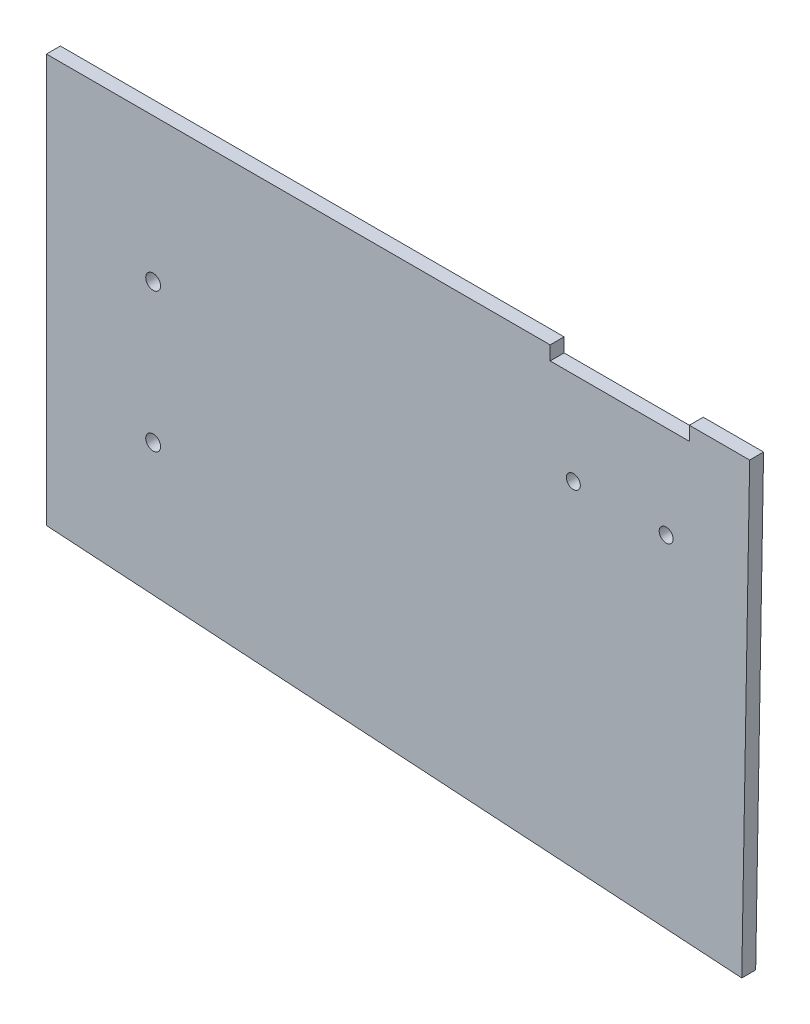
ISO-10303-21;
HEADER;
FILE_DESCRIPTION(('STEP AP214'),'2;1');
FILE_NAME('part.step','',(''),(''),'','','');
FILE_SCHEMA(('AUTOMOTIVE_DESIGN { 1 0 10303 214 1 1 1 1 }'));
ENDSEC;
DATA;
#1=APPLICATION_CONTEXT('core data for automotive mechanical design processes');
#2=APPLICATION_PROTOCOL_DEFINITION('international standard','automotive_design',2000,#1);
#3=PRODUCT_CONTEXT('',#1,'mechanical');
#4=PRODUCT('Part','Part','',(#3));
#5=PRODUCT_RELATED_PRODUCT_CATEGORY('part','',(#4));
#6=PRODUCT_DEFINITION_FORMATION('','',#4);
#7=PRODUCT_DEFINITION_CONTEXT('part definition',#1,'design');
#8=PRODUCT_DEFINITION('design','',#6,#7);
#9=PRODUCT_DEFINITION_SHAPE('','',#8);
#10=(LENGTH_UNIT() NAMED_UNIT(*) SI_UNIT(.MILLI.,.METRE.));
#11=(NAMED_UNIT(*) PLANE_ANGLE_UNIT() SI_UNIT($,.RADIAN.));
#12=(NAMED_UNIT(*) SI_UNIT($,.STERADIAN.) SOLID_ANGLE_UNIT());
#13=UNCERTAINTY_MEASURE_WITH_UNIT(LENGTH_MEASURE(1.E-05),#10,'distance_accuracy_value','');
#14=(GEOMETRIC_REPRESENTATION_CONTEXT(3) GLOBAL_UNCERTAINTY_ASSIGNED_CONTEXT((#13)) GLOBAL_UNIT_ASSIGNED_CONTEXT((#10,
#11,#12)) REPRESENTATION_CONTEXT('',''));
#15=CARTESIAN_POINT('',(0.,0.,0.));
#16=DIRECTION('',(0.,0.,1.));
#17=DIRECTION('',(1.,0.,0.));
#18=AXIS2_PLACEMENT_3D('',#15,#16,#17);
#19=CARTESIAN_POINT('',(-33.3553390593279,3.00000000000293,3.));
#20=DIRECTION('',(0.,-1.,0.));
#21=DIRECTION('',(0.,0.,-1.));
#22=AXIS2_PLACEMENT_3D('',#19,#20,#21);
#23=PLANE('',#22);
#24=DIRECTION('',(-1.,0.,0.));
#25=VECTOR('',#24,1.);
#26=CARTESIAN_POINT('',(-33.3553390593279,3.00000000000293,0.));
#27=LINE('',#26,#25);
#28=CARTESIAN_POINT('',(118.208152801713,3.00000000000293,0.));
#29=VERTEX_POINT('',#28);
#30=CARTESIAN_POINT('',(105.208152801713,3.00000000000293,0.));
#31=VERTEX_POINT('',#30);
#32=EDGE_CURVE('E124',#29,#31,#27,.T.);
#33=ORIENTED_EDGE('',*,*,#32,.T.);
#34=DIRECTION('',(0.,0.,1.));
#35=VECTOR('',#34,1.);
#36=CARTESIAN_POINT('',(105.208152801713,3.00000000000293,0.));
#37=LINE('',#36,#35);
#38=CARTESIAN_POINT('',(105.208152801713,3.00000000000293,3.));
#39=VERTEX_POINT('',#38);
#40=EDGE_CURVE('E151',#31,#39,#37,.T.);
#41=ORIENTED_EDGE('',*,*,#40,.T.);
#42=DIRECTION('',(-1.,0.,0.));
#43=VECTOR('',#42,1.);
#44=CARTESIAN_POINT('',(-33.3553390593279,3.00000000000293,3.));
#45=LINE('',#44,#43);
#46=CARTESIAN_POINT('',(118.208152801713,3.00000000000293,3.));
#47=VERTEX_POINT('',#46);
#48=EDGE_CURVE('E136',#47,#39,#45,.T.);
#49=ORIENTED_EDGE('',*,*,#48,.F.);
#50=DIRECTION('',(0.,0.,-1.));
#51=VECTOR('',#50,1.);
#52=CARTESIAN_POINT('',(118.208152801713,3.00000000000293,3.));
#53=LINE('',#52,#51);
#54=EDGE_CURVE('E135',#47,#29,#53,.T.);
#55=ORIENTED_EDGE('',*,*,#54,.T.);
#56=EDGE_LOOP('',(#33,#41,#49,#55));
#57=FACE_BOUND('',#56,.T.);
#58=ADVANCED_FACE('F35',(#57),#23,.F.);
#59=CARTESIAN_POINT('',(-33.3553390593279,3.00000000000293,3.));
#60=DIRECTION('',(1.,0.,0.));
#61=DIRECTION('',(0.,1.,0.));
#62=AXIS2_PLACEMENT_3D('',#59,#60,#61);
#63=PLANE('',#62);
#64=DIRECTION('',(0.,-1.,0.));
#65=VECTOR('',#64,1.);
#66=CARTESIAN_POINT('',(-33.3553390593279,3.00000000000293,0.));
#67=LINE('',#66,#65);
#68=CARTESIAN_POINT('',(-33.3553390593279,3.00000000000293,0.));
#69=VERTEX_POINT('',#68);
#70=CARTESIAN_POINT('',(-33.3553390593278,-84.9999999999971,0.));
#71=VERTEX_POINT('',#70);
#72=EDGE_CURVE('E123',#69,#71,#67,.T.);
#73=ORIENTED_EDGE('',*,*,#72,.T.);
#74=DIRECTION('',(0.,0.,-1.));
#75=VECTOR('',#74,1.);
#76=CARTESIAN_POINT('',(-33.3553390593278,-84.9999999999971,3.));
#77=LINE('',#76,#75);
#78=CARTESIAN_POINT('',(-33.3553390593278,-84.9999999999971,3.));
#79=VERTEX_POINT('',#78);
#80=EDGE_CURVE('E11',#79,#71,#77,.T.);
#81=ORIENTED_EDGE('',*,*,#80,.F.);
#82=DIRECTION('',(0.,-1.,0.));
#83=VECTOR('',#82,1.);
#84=CARTESIAN_POINT('',(-33.3553390593279,3.00000000000293,3.));
#85=LINE('',#84,#83);
#86=CARTESIAN_POINT('',(-33.3553390593279,3.00000000000293,3.));
#87=VERTEX_POINT('',#86);
#88=EDGE_CURVE('E128',#87,#79,#85,.T.);
#89=ORIENTED_EDGE('',*,*,#88,.F.);
#90=DIRECTION('',(0.,0.,-1.));
#91=VECTOR('',#90,1.);
#92=CARTESIAN_POINT('',(-33.3553390593279,3.00000000000293,3.));
#93=LINE('',#92,#91);
#94=EDGE_CURVE('E133',#87,#69,#93,.T.);
#95=ORIENTED_EDGE('',*,*,#94,.T.);
#96=EDGE_LOOP('',(#73,#81,#89,#95));
#97=FACE_BOUND('',#96,.T.);
#98=ADVANCED_FACE('F37',(#97),#63,.F.);
#99=CARTESIAN_POINT('',(-33.3553390593278,-84.9999999999971,3.));
#100=DIRECTION('',(0.0634390043980716,0.997985717693886,0.));
#101=DIRECTION('',(-0.997985717693886,0.0634390043980716,0.));
#102=AXIS2_PLACEMENT_3D('',#99,#100,#101);
#103=PLANE('',#102);
#104=DIRECTION('',(0.997985717693886,-0.0634390043980716,0.));
#105=VECTOR('',#104,1.);
#106=CARTESIAN_POINT('',(-33.3553390593278,-84.9999999999971,0.));
#107=LINE('',#106,#105);
#108=CARTESIAN_POINT('',(116.505826096315,-94.5262316352328,0.));
#109=VERTEX_POINT('',#108);
#110=EDGE_CURVE('E129',#71,#109,#107,.T.);
#111=ORIENTED_EDGE('',*,*,#110,.T.);
#112=DIRECTION('',(0.,0.,-1.));
#113=VECTOR('',#112,1.);
#114=CARTESIAN_POINT('',(116.505826096315,-94.5262316352328,3.));
#115=LINE('',#114,#113);
#116=CARTESIAN_POINT('',(116.505826096315,-94.5262316352328,3.));
#117=VERTEX_POINT('',#116);
#118=EDGE_CURVE('E43',#117,#109,#115,.T.);
#119=ORIENTED_EDGE('',*,*,#118,.F.);
#120=DIRECTION('',(0.997985717693886,-0.0634390043980716,0.));
#121=VECTOR('',#120,1.);
#122=CARTESIAN_POINT('',(-33.3553390593278,-84.9999999999971,3.));
#123=LINE('',#122,#121);
#124=EDGE_CURVE('E88',#79,#117,#123,.T.);
#125=ORIENTED_EDGE('',*,*,#124,.F.);
#126=ORIENTED_EDGE('',*,*,#80,.T.);
#127=EDGE_LOOP('',(#111,#119,#125,#126));
#128=FACE_BOUND('',#127,.T.);
#129=ADVANCED_FACE('F158',(#128),#103,.F.);
#130=CARTESIAN_POINT('',(118.208152801713,3.00000000000293,3.));
#131=DIRECTION('',(-0.999847695156391,0.017452406437287,0.));
#132=DIRECTION('',(-0.017452406437287,-0.999847695156391,0.));
#133=AXIS2_PLACEMENT_3D('',#130,#131,#132);
#134=PLANE('',#133);
#135=DIRECTION('',(0.017452406437287,0.999847695156391,0.));
#136=VECTOR('',#135,1.);
#137=CARTESIAN_POINT('',(118.208152801713,3.00000000000293,0.));
#138=LINE('',#137,#136);
#139=EDGE_CURVE('E125',#109,#29,#138,.T.);
#140=ORIENTED_EDGE('',*,*,#139,.T.);
#141=ORIENTED_EDGE('',*,*,#54,.F.);
#142=DIRECTION('',(0.017452406437287,0.999847695156391,0.));
#143=VECTOR('',#142,1.);
#144=CARTESIAN_POINT('',(118.208152801713,3.00000000000293,3.));
#145=LINE('',#144,#143);
#146=EDGE_CURVE('E144',#117,#47,#145,.T.);
#147=ORIENTED_EDGE('',*,*,#146,.F.);
#148=ORIENTED_EDGE('',*,*,#118,.T.);
#149=EDGE_LOOP('',(#140,#141,#147,#148));
#150=FACE_BOUND('',#149,.T.);
#151=ADVANCED_FACE('F142',(#150),#134,.F.);
#152=CARTESIAN_POINT('',(75.2081528017128,3.00000000000293,3.));
#153=VERTEX_POINT('',#152);
#154=EDGE_CURVE('E59',#153,#87,#45,.T.);
#155=ORIENTED_EDGE('',*,*,#154,.F.);
#156=DIRECTION('',(0.,0.,1.));
#157=VECTOR('',#156,1.);
#158=CARTESIAN_POINT('',(75.2081528017128,3.00000000000293,0.));
#159=LINE('',#158,#157);
#160=CARTESIAN_POINT('',(75.2081528017128,3.00000000000293,0.));
#161=VERTEX_POINT('',#160);
#162=EDGE_CURVE('E112',#161,#153,#159,.T.);
#163=ORIENTED_EDGE('',*,*,#162,.F.);
#164=EDGE_CURVE('E81',#161,#69,#27,.T.);
#165=ORIENTED_EDGE('',*,*,#164,.T.);
#166=ORIENTED_EDGE('',*,*,#94,.F.);
#167=EDGE_LOOP('',(#155,#163,#165,#166));
#168=FACE_BOUND('',#167,.T.);
#169=ADVANCED_FACE('F117',(#168),#23,.F.);
#170=CARTESIAN_POINT('',(0.,0.,3.));
#171=DIRECTION('',(0.,0.,1.));
#172=DIRECTION('',(1.,0.,0.));
#173=AXIS2_PLACEMENT_3D('',#170,#171,#172);
#174=PLANE('',#173);
#175=CARTESIAN_POINT('',(-10.3553390593281,-28.,3.));
#176=DIRECTION('',(0.,0.,-1.));
#177=DIRECTION('',(-1.,0.,0.));
#178=AXIS2_PLACEMENT_3D('',#175,#176,#177);
#179=CIRCLE('',#178,1.59999999999999);
#180=CARTESIAN_POINT('',(-11.9553390593281,-28.,3.));
#181=VERTEX_POINT('',#180);
#182=EDGE_CURVE('E168',#181,#181,#179,.T.);
#183=ORIENTED_EDGE('',*,*,#182,.T.);
#184=EDGE_LOOP('',(#183));
#185=FACE_BOUND('',#184,.T.);
#186=CARTESIAN_POINT('',(-10.3553390593281,-58.,3.));
#187=DIRECTION('',(0.,0.,-1.));
#188=DIRECTION('',(-1.,0.,0.));
#189=AXIS2_PLACEMENT_3D('',#186,#187,#188);
#190=CIRCLE('',#189,1.59999999999999);
#191=CARTESIAN_POINT('',(-11.9553390593281,-58.,3.));
#192=VERTEX_POINT('',#191);
#193=EDGE_CURVE('E192',#192,#192,#190,.T.);
#194=ORIENTED_EDGE('',*,*,#193,.T.);
#195=EDGE_LOOP('',(#194));
#196=FACE_BOUND('',#195,.T.);
#197=DIRECTION('',(0.,1.,0.));
#198=VECTOR('',#197,1.);
#199=CARTESIAN_POINT('',(105.208152801713,0.,3.));
#200=LINE('',#199,#198);
#201=CARTESIAN_POINT('',(105.208152801713,0.,3.));
#202=VERTEX_POINT('',#201);
#203=EDGE_CURVE('E115',#202,#39,#200,.T.);
#204=ORIENTED_EDGE('',*,*,#203,.F.);
#205=DIRECTION('',(1.,0.,0.));
#206=VECTOR('',#205,1.);
#207=CARTESIAN_POINT('',(0.,0.,3.));
#208=LINE('',#207,#206);
#209=CARTESIAN_POINT('',(75.2081528017128,0.,3.));
#210=VERTEX_POINT('',#209);
#211=EDGE_CURVE('E183',#210,#202,#208,.T.);
#212=ORIENTED_EDGE('',*,*,#211,.F.);
#213=DIRECTION('',(0.,-1.,0.));
#214=VECTOR('',#213,1.);
#215=CARTESIAN_POINT('',(75.2081528017128,-3.47907595332946E-13,3.));
#216=LINE('',#215,#214);
#217=EDGE_CURVE('E176',#153,#210,#216,.T.);
#218=ORIENTED_EDGE('',*,*,#217,.F.);
#219=ORIENTED_EDGE('',*,*,#154,.T.);
#220=ORIENTED_EDGE('',*,*,#88,.T.);
#221=ORIENTED_EDGE('',*,*,#124,.T.);
#222=ORIENTED_EDGE('',*,*,#146,.T.);
#223=ORIENTED_EDGE('',*,*,#48,.T.);
#224=EDGE_LOOP('',(#204,#212,#218,#219,#220,#221,#222,#223));
#225=FACE_BOUND('',#224,.T.);
#226=CARTESIAN_POINT('',(80.2081528017128,-20.,3.));
#227=DIRECTION('',(0.,0.,1.));
#228=DIRECTION('',(1.,0.,0.));
#229=AXIS2_PLACEMENT_3D('',#226,#227,#228);
#230=CIRCLE('',#229,1.5);
#231=CARTESIAN_POINT('',(81.7081528017128,-20.,3.));
#232=VERTEX_POINT('',#231);
#233=EDGE_CURVE('E171',#232,#232,#230,.T.);
#234=ORIENTED_EDGE('',*,*,#233,.F.);
#235=EDGE_LOOP('',(#234));
#236=FACE_BOUND('',#235,.T.);
#237=CARTESIAN_POINT('',(100.208152801713,-20.,3.));
#238=DIRECTION('',(0.,0.,1.));
#239=DIRECTION('',(1.,0.,0.));
#240=AXIS2_PLACEMENT_3D('',#237,#238,#239);
#241=CIRCLE('',#240,1.5);
#242=CARTESIAN_POINT('',(101.708152801713,-20.,3.));
#243=VERTEX_POINT('',#242);
#244=EDGE_CURVE('E164',#243,#243,#241,.T.);
#245=ORIENTED_EDGE('',*,*,#244,.F.);
#246=EDGE_LOOP('',(#245));
#247=FACE_BOUND('',#246,.T.);
#248=ADVANCED_FACE('F201',(#185,#196,#225,#236,#247),#174,.T.);
#249=CARTESIAN_POINT('',(0.,0.,0.));
#250=DIRECTION('',(0.,0.,1.));
#251=DIRECTION('',(1.,0.,0.));
#252=AXIS2_PLACEMENT_3D('',#249,#250,#251);
#253=PLANE('',#252);
#254=CARTESIAN_POINT('',(-10.3553390593281,-28.,0.));
#255=DIRECTION('',(0.,0.,-1.));
#256=DIRECTION('',(-1.,0.,0.));
#257=AXIS2_PLACEMENT_3D('',#254,#255,#256);
#258=CIRCLE('',#257,1.59999999999999);
#259=CARTESIAN_POINT('',(-11.9553390593281,-28.,0.));
#260=VERTEX_POINT('',#259);
#261=EDGE_CURVE('E195',#260,#260,#258,.T.);
#262=ORIENTED_EDGE('',*,*,#261,.F.);
#263=EDGE_LOOP('',(#262));
#264=FACE_BOUND('',#263,.T.);
#265=CARTESIAN_POINT('',(-10.3553390593281,-58.,0.));
#266=DIRECTION('',(0.,0.,-1.));
#267=DIRECTION('',(-1.,0.,0.));
#268=AXIS2_PLACEMENT_3D('',#265,#266,#267);
#269=CIRCLE('',#268,1.59999999999999);
#270=CARTESIAN_POINT('',(-11.9553390593281,-58.,0.));
#271=VERTEX_POINT('',#270);
#272=EDGE_CURVE('E189',#271,#271,#269,.T.);
#273=ORIENTED_EDGE('',*,*,#272,.F.);
#274=EDGE_LOOP('',(#273));
#275=FACE_BOUND('',#274,.T.);
#276=CARTESIAN_POINT('',(80.2081528017128,-20.,0.));
#277=DIRECTION('',(0.,0.,1.));
#278=DIRECTION('',(1.,0.,0.));
#279=AXIS2_PLACEMENT_3D('',#276,#277,#278);
#280=CIRCLE('',#279,1.5);
#281=CARTESIAN_POINT('',(81.7081528017128,-20.,0.));
#282=VERTEX_POINT('',#281);
#283=EDGE_CURVE('E174',#282,#282,#280,.T.);
#284=ORIENTED_EDGE('',*,*,#283,.T.);
#285=EDGE_LOOP('',(#284));
#286=FACE_BOUND('',#285,.T.);
#287=CARTESIAN_POINT('',(100.208152801713,-20.,0.));
#288=DIRECTION('',(0.,0.,1.));
#289=DIRECTION('',(1.,0.,0.));
#290=AXIS2_PLACEMENT_3D('',#287,#288,#289);
#291=CIRCLE('',#290,1.5);
#292=CARTESIAN_POINT('',(101.708152801713,-20.,0.));
#293=VERTEX_POINT('',#292);
#294=EDGE_CURVE('E167',#293,#293,#291,.T.);
#295=ORIENTED_EDGE('',*,*,#294,.T.);
#296=EDGE_LOOP('',(#295));
#297=FACE_BOUND('',#296,.T.);
#298=DIRECTION('',(1.,0.,0.));
#299=VECTOR('',#298,1.);
#300=CARTESIAN_POINT('',(0.,0.,0.));
#301=LINE('',#300,#299);
#302=CARTESIAN_POINT('',(75.2081528017128,0.,0.));
#303=VERTEX_POINT('',#302);
#304=CARTESIAN_POINT('',(105.208152801713,0.,0.));
#305=VERTEX_POINT('',#304);
#306=EDGE_CURVE('E50',#303,#305,#301,.T.);
#307=ORIENTED_EDGE('',*,*,#306,.T.);
#308=DIRECTION('',(0.,1.,0.));
#309=VECTOR('',#308,1.);
#310=CARTESIAN_POINT('',(105.208152801713,0.,0.));
#311=LINE('',#310,#309);
#312=EDGE_CURVE('E118',#305,#31,#311,.T.);
#313=ORIENTED_EDGE('',*,*,#312,.T.);
#314=ORIENTED_EDGE('',*,*,#32,.F.);
#315=ORIENTED_EDGE('',*,*,#139,.F.);
#316=ORIENTED_EDGE('',*,*,#110,.F.);
#317=ORIENTED_EDGE('',*,*,#72,.F.);
#318=ORIENTED_EDGE('',*,*,#164,.F.);
#319=DIRECTION('',(0.,-1.,0.));
#320=VECTOR('',#319,1.);
#321=CARTESIAN_POINT('',(75.2081528017128,-3.47907595332946E-13,0.));
#322=LINE('',#321,#320);
#323=EDGE_CURVE('E109',#161,#303,#322,.T.);
#324=ORIENTED_EDGE('',*,*,#323,.T.);
#325=EDGE_LOOP('',(#307,#313,#314,#315,#316,#317,#318,#324));
#326=FACE_BOUND('',#325,.T.);
#327=ADVANCED_FACE('F121',(#264,#275,#286,#297,#326),#253,.F.);
#328=CARTESIAN_POINT('',(100.208152801713,-20.,0.));
#329=DIRECTION('',(0.,0.,1.));
#330=DIRECTION('',(1.,0.,0.));
#331=AXIS2_PLACEMENT_3D('',#328,#329,#330);
#332=CYLINDRICAL_SURFACE('',#331,1.5);
#333=ORIENTED_EDGE('',*,*,#294,.F.);
#334=EDGE_LOOP('',(#333));
#335=FACE_BOUND('',#334,.T.);
#336=ORIENTED_EDGE('',*,*,#244,.T.);
#337=EDGE_LOOP('',(#336));
#338=FACE_BOUND('',#337,.T.);
#339=ADVANCED_FACE('F213',(#335,#338),#332,.F.);
#340=CARTESIAN_POINT('',(80.2081528017128,-20.,0.));
#341=DIRECTION('',(0.,0.,1.));
#342=DIRECTION('',(1.,0.,0.));
#343=AXIS2_PLACEMENT_3D('',#340,#341,#342);
#344=CYLINDRICAL_SURFACE('',#343,1.5);
#345=ORIENTED_EDGE('',*,*,#283,.F.);
#346=EDGE_LOOP('',(#345));
#347=FACE_BOUND('',#346,.T.);
#348=ORIENTED_EDGE('',*,*,#233,.T.);
#349=EDGE_LOOP('',(#348));
#350=FACE_BOUND('',#349,.T.);
#351=ADVANCED_FACE('F223',(#347,#350),#344,.F.);
#352=CARTESIAN_POINT('',(105.208152801713,0.,0.));
#353=DIRECTION('',(1.,0.,0.));
#354=DIRECTION('',(0.,0.,-1.));
#355=AXIS2_PLACEMENT_3D('',#352,#353,#354);
#356=PLANE('',#355);
#357=ORIENTED_EDGE('',*,*,#203,.T.);
#358=ORIENTED_EDGE('',*,*,#40,.F.);
#359=ORIENTED_EDGE('',*,*,#312,.F.);
#360=DIRECTION('',(0.,0.,1.));
#361=VECTOR('',#360,1.);
#362=CARTESIAN_POINT('',(105.208152801713,0.,0.));
#363=LINE('',#362,#361);
#364=EDGE_CURVE('E179',#305,#202,#363,.T.);
#365=ORIENTED_EDGE('',*,*,#364,.T.);
#366=EDGE_LOOP('',(#357,#358,#359,#365));
#367=FACE_BOUND('',#366,.T.);
#368=ADVANCED_FACE('F270',(#367),#356,.F.);
#369=CARTESIAN_POINT('',(0.,0.,0.));
#370=DIRECTION('',(0.,-1.,0.));
#371=DIRECTION('',(1.,0.,0.));
#372=AXIS2_PLACEMENT_3D('',#369,#370,#371);
#373=PLANE('',#372);
#374=ORIENTED_EDGE('',*,*,#211,.T.);
#375=ORIENTED_EDGE('',*,*,#364,.F.);
#376=ORIENTED_EDGE('',*,*,#306,.F.);
#377=DIRECTION('',(0.,0.,1.));
#378=VECTOR('',#377,1.);
#379=CARTESIAN_POINT('',(75.2081528017128,0.,0.));
#380=LINE('',#379,#378);
#381=EDGE_CURVE('E113',#303,#210,#380,.T.);
#382=ORIENTED_EDGE('',*,*,#381,.T.);
#383=EDGE_LOOP('',(#374,#375,#376,#382));
#384=FACE_BOUND('',#383,.T.);
#385=ADVANCED_FACE('F280',(#384),#373,.F.);
#386=CARTESIAN_POINT('',(75.2081528017128,-3.47907595332946E-13,0.));
#387=DIRECTION('',(-1.,0.,0.));
#388=DIRECTION('',(0.,-1.,0.));
#389=AXIS2_PLACEMENT_3D('',#386,#387,#388);
#390=PLANE('',#389);
#391=ORIENTED_EDGE('',*,*,#217,.T.);
#392=ORIENTED_EDGE('',*,*,#381,.F.);
#393=ORIENTED_EDGE('',*,*,#323,.F.);
#394=ORIENTED_EDGE('',*,*,#162,.T.);
#395=EDGE_LOOP('',(#391,#392,#393,#394));
#396=FACE_BOUND('',#395,.T.);
#397=ADVANCED_FACE('F111',(#396),#390,.F.);
#398=CARTESIAN_POINT('',(-10.3553390593281,-58.,3.));
#399=DIRECTION('',(0.,0.,-1.));
#400=DIRECTION('',(-1.,0.,0.));
#401=AXIS2_PLACEMENT_3D('',#398,#399,#400);
#402=CYLINDRICAL_SURFACE('',#401,1.59999999999999);
#403=ORIENTED_EDGE('',*,*,#193,.F.);
#404=EDGE_LOOP('',(#403));
#405=FACE_BOUND('',#404,.T.);
#406=ORIENTED_EDGE('',*,*,#272,.T.);
#407=EDGE_LOOP('',(#406));
#408=FACE_BOUND('',#407,.T.);
#409=ADVANCED_FACE('F207',(#405,#408),#402,.F.);
#410=CARTESIAN_POINT('',(-10.3553390593281,-28.,3.));
#411=DIRECTION('',(0.,0.,-1.));
#412=DIRECTION('',(-1.,0.,0.));
#413=AXIS2_PLACEMENT_3D('',#410,#411,#412);
#414=CYLINDRICAL_SURFACE('',#413,1.59999999999999);
#415=ORIENTED_EDGE('',*,*,#182,.F.);
#416=EDGE_LOOP('',(#415));
#417=FACE_BOUND('',#416,.T.);
#418=ORIENTED_EDGE('',*,*,#261,.T.);
#419=EDGE_LOOP('',(#418));
#420=FACE_BOUND('',#419,.T.);
#421=ADVANCED_FACE('F204',(#417,#420),#414,.F.);
#422=CLOSED_SHELL('',(#58,#98,#129,#151,#169,#248,#327,#339,#351,#368,#385,#397,#409,#421));
#423=MANIFOLD_SOLID_BREP('B2',#422);
#424=ADVANCED_BREP_SHAPE_REPRESENTATION('',(#18,#423),#14);
#425=SHAPE_DEFINITION_REPRESENTATION(#9,#424);
ENDSEC;
END-ISO-10303-21;
